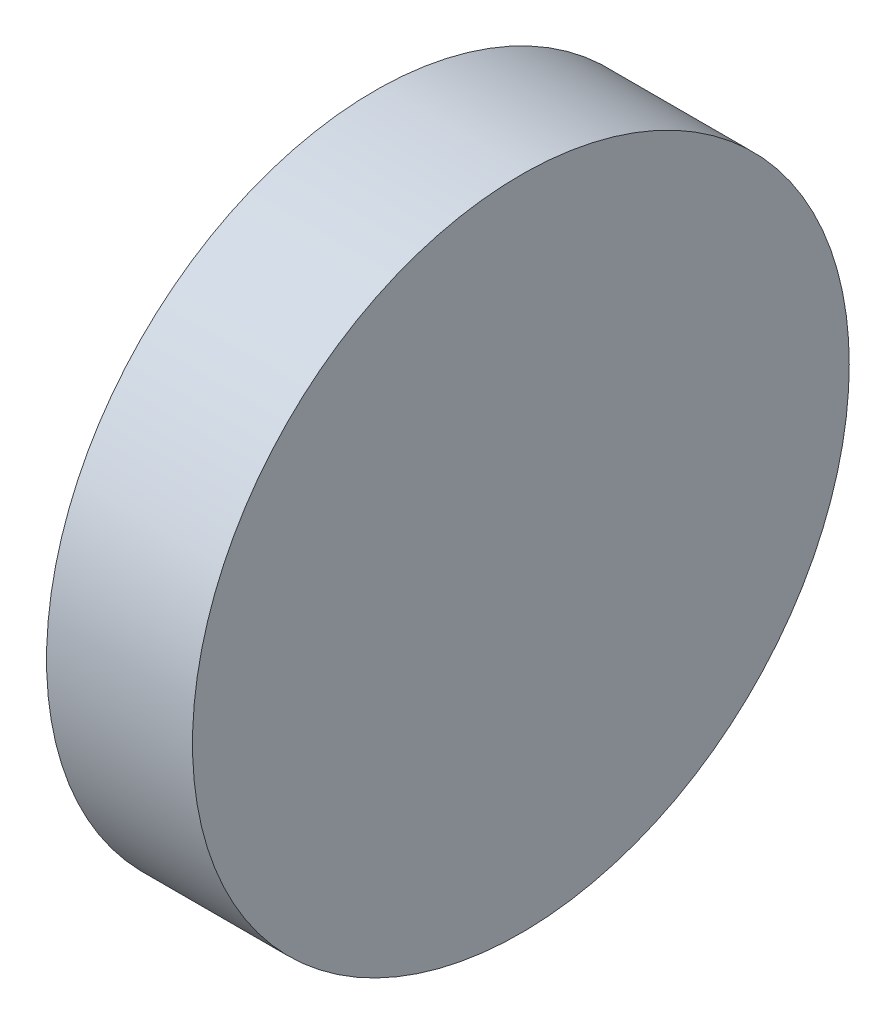
ISO-10303-21;
HEADER;
FILE_DESCRIPTION(('STEP AP214'),'2;1');
FILE_NAME('part.step','',(''),(''),'','','');
FILE_SCHEMA(('AUTOMOTIVE_DESIGN { 1 0 10303 214 1 1 1 1 }'));
ENDSEC;
DATA;
#1=APPLICATION_CONTEXT('core data for automotive mechanical design processes');
#2=APPLICATION_PROTOCOL_DEFINITION('international standard','automotive_design',2000,#1);
#3=PRODUCT_CONTEXT('',#1,'mechanical');
#4=PRODUCT('Part','Part','',(#3));
#5=PRODUCT_RELATED_PRODUCT_CATEGORY('part','',(#4));
#6=PRODUCT_DEFINITION_FORMATION('','',#4);
#7=PRODUCT_DEFINITION_CONTEXT('part definition',#1,'design');
#8=PRODUCT_DEFINITION('design','',#6,#7);
#9=PRODUCT_DEFINITION_SHAPE('','',#8);
#10=(LENGTH_UNIT() NAMED_UNIT(*) SI_UNIT(.MILLI.,.METRE.));
#11=(NAMED_UNIT(*) PLANE_ANGLE_UNIT() SI_UNIT($,.RADIAN.));
#12=(NAMED_UNIT(*) SI_UNIT($,.STERADIAN.) SOLID_ANGLE_UNIT());
#13=UNCERTAINTY_MEASURE_WITH_UNIT(LENGTH_MEASURE(1.E-05),#10,'distance_accuracy_value','');
#14=(GEOMETRIC_REPRESENTATION_CONTEXT(3) GLOBAL_UNCERTAINTY_ASSIGNED_CONTEXT((#13)) GLOBAL_UNIT_ASSIGNED_CONTEXT((#10,
#11,#12)) REPRESENTATION_CONTEXT('',''));
#15=CARTESIAN_POINT('',(0.,0.,0.));
#16=DIRECTION('',(0.,0.,1.));
#17=DIRECTION('',(1.,0.,0.));
#18=AXIS2_PLACEMENT_3D('',#15,#16,#17);
#19=CARTESIAN_POINT('',(10.,0.,0.));
#20=DIRECTION('',(-1.,0.,0.));
#21=DIRECTION('',(0.,0.,1.));
#22=AXIS2_PLACEMENT_3D('',#19,#20,#21);
#23=CYLINDRICAL_SURFACE('',#22,22.5);
#24=CARTESIAN_POINT('',(10.,0.,0.));
#25=DIRECTION('',(1.,0.,0.));
#26=DIRECTION('',(0.,0.,-1.));
#27=AXIS2_PLACEMENT_3D('',#24,#25,#26);
#28=CIRCLE('',#27,22.5);
#29=CARTESIAN_POINT('',(10.,0.,-22.5));
#30=VERTEX_POINT('',#29);
#31=EDGE_CURVE('E10',#30,#30,#28,.T.);
#32=ORIENTED_EDGE('',*,*,#31,.F.);
#33=EDGE_LOOP('',(#32));
#34=FACE_BOUND('',#33,.T.);
#35=CARTESIAN_POINT('',(0.,0.,0.));
#36=DIRECTION('',(1.,0.,0.));
#37=DIRECTION('',(0.,0.,-1.));
#38=AXIS2_PLACEMENT_3D('',#35,#36,#37);
#39=CIRCLE('',#38,22.5);
#40=CARTESIAN_POINT('',(0.,0.,-22.5));
#41=VERTEX_POINT('',#40);
#42=EDGE_CURVE('E34',#41,#41,#39,.T.);
#43=ORIENTED_EDGE('',*,*,#42,.T.);
#44=EDGE_LOOP('',(#43));
#45=FACE_BOUND('',#44,.T.);
#46=ADVANCED_FACE('F31',(#34,#45),#23,.T.);
#47=CARTESIAN_POINT('',(10.,0.,0.));
#48=DIRECTION('',(1.,0.,0.));
#49=DIRECTION('',(0.,0.,-1.));
#50=AXIS2_PLACEMENT_3D('',#47,#48,#49);
#51=PLANE('',#50);
#52=ORIENTED_EDGE('',*,*,#31,.T.);
#53=EDGE_LOOP('',(#52));
#54=FACE_BOUND('',#53,.T.);
#55=ADVANCED_FACE('F46',(#54),#51,.T.);
#56=CARTESIAN_POINT('',(0.,0.,0.));
#57=DIRECTION('',(1.,0.,0.));
#58=DIRECTION('',(0.,0.,-1.));
#59=AXIS2_PLACEMENT_3D('',#56,#57,#58);
#60=PLANE('',#59);
#61=ORIENTED_EDGE('',*,*,#42,.F.);
#62=EDGE_LOOP('',(#61));
#63=FACE_BOUND('',#62,.T.);
#64=ADVANCED_FACE('F44',(#63),#60,.F.);
#65=CLOSED_SHELL('',(#46,#55,#64));
#66=MANIFOLD_SOLID_BREP('B2',#65);
#67=ADVANCED_BREP_SHAPE_REPRESENTATION('',(#18,#66),#14);
#68=SHAPE_DEFINITION_REPRESENTATION(#9,#67);
ENDSEC;
END-ISO-10303-21;
